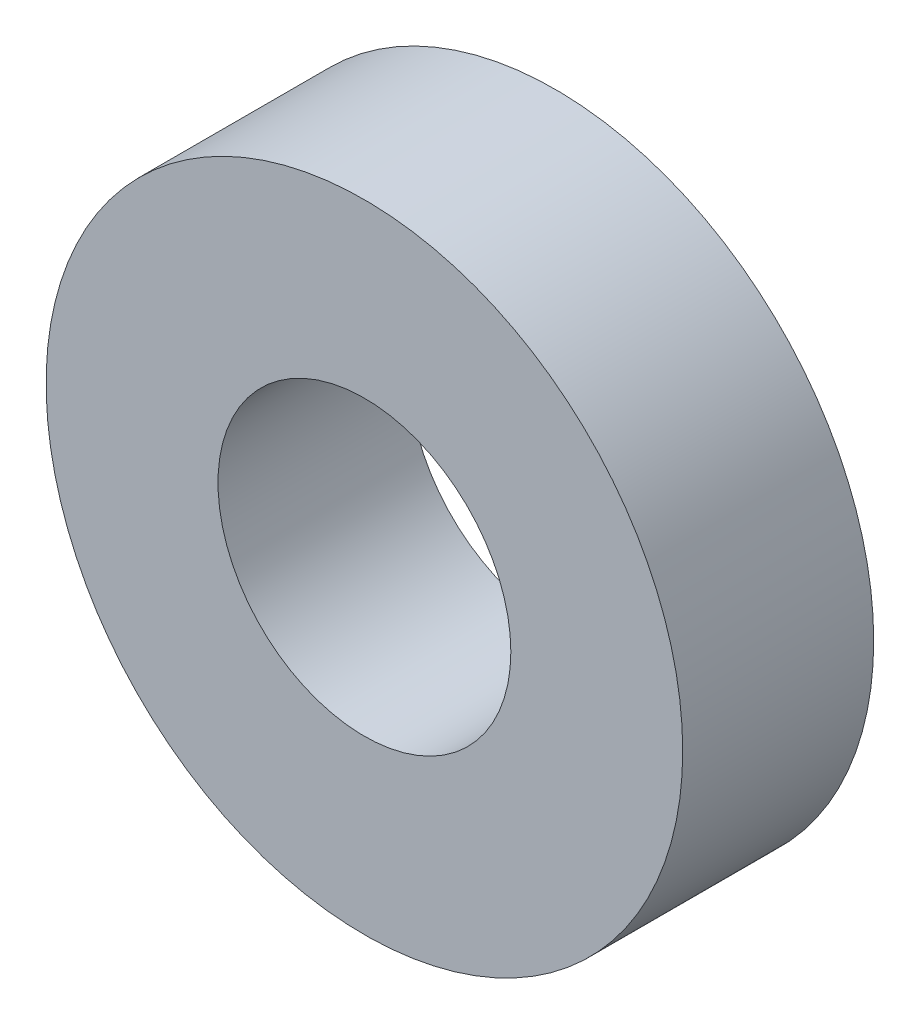
ISO-10303-21;
HEADER;
FILE_DESCRIPTION(('STEP AP214'),'2;1');
FILE_NAME('part.step','',(''),(''),'','','');
FILE_SCHEMA(('AUTOMOTIVE_DESIGN { 1 0 10303 214 1 1 1 1 }'));
ENDSEC;
DATA;
#1=APPLICATION_CONTEXT('core data for automotive mechanical design processes');
#2=APPLICATION_PROTOCOL_DEFINITION('international standard','automotive_design',2000,#1);
#3=PRODUCT_CONTEXT('',#1,'mechanical');
#4=PRODUCT('Part','Part','',(#3));
#5=PRODUCT_RELATED_PRODUCT_CATEGORY('part','',(#4));
#6=PRODUCT_DEFINITION_FORMATION('','',#4);
#7=PRODUCT_DEFINITION_CONTEXT('part definition',#1,'design');
#8=PRODUCT_DEFINITION('design','',#6,#7);
#9=PRODUCT_DEFINITION_SHAPE('','',#8);
#10=(LENGTH_UNIT() NAMED_UNIT(*) SI_UNIT(.MILLI.,.METRE.));
#11=(NAMED_UNIT(*) PLANE_ANGLE_UNIT() SI_UNIT($,.RADIAN.));
#12=(NAMED_UNIT(*) SI_UNIT($,.STERADIAN.) SOLID_ANGLE_UNIT());
#13=UNCERTAINTY_MEASURE_WITH_UNIT(LENGTH_MEASURE(1.E-05),#10,'distance_accuracy_value','');
#14=(GEOMETRIC_REPRESENTATION_CONTEXT(3) GLOBAL_UNCERTAINTY_ASSIGNED_CONTEXT((#13)) GLOBAL_UNIT_ASSIGNED_CONTEXT((#10,
#11,#12)) REPRESENTATION_CONTEXT('',''));
#15=CARTESIAN_POINT('',(0.,0.,0.));
#16=DIRECTION('',(0.,0.,1.));
#17=DIRECTION('',(1.,0.,0.));
#18=AXIS2_PLACEMENT_3D('',#15,#16,#17);
#19=CARTESIAN_POINT('',(0.,0.,3.));
#20=DIRECTION('',(0.,0.,1.));
#21=DIRECTION('',(1.,0.,0.));
#22=AXIS2_PLACEMENT_3D('',#19,#20,#21);
#23=PLANE('',#22);
#24=CARTESIAN_POINT('',(0.,0.,3.));
#25=DIRECTION('',(0.,0.,1.));
#26=DIRECTION('',(1.,0.,0.));
#27=AXIS2_PLACEMENT_3D('',#24,#25,#26);
#28=CIRCLE('',#27,5.);
#29=CARTESIAN_POINT('',(5.,0.,3.));
#30=VERTEX_POINT('',#29);
#31=EDGE_CURVE('E10',#30,#30,#28,.T.);
#32=ORIENTED_EDGE('',*,*,#31,.T.);
#33=EDGE_LOOP('',(#32));
#34=FACE_BOUND('',#33,.T.);
#35=CARTESIAN_POINT('',(0.,0.,3.));
#36=DIRECTION('',(0.,0.,1.));
#37=DIRECTION('',(1.,0.,0.));
#38=AXIS2_PLACEMENT_3D('',#35,#36,#37);
#39=CIRCLE('',#38,2.3);
#40=CARTESIAN_POINT('',(2.3,0.,3.));
#41=VERTEX_POINT('',#40);
#42=EDGE_CURVE('E41',#41,#41,#39,.T.);
#43=ORIENTED_EDGE('',*,*,#42,.F.);
#44=EDGE_LOOP('',(#43));
#45=FACE_BOUND('',#44,.T.);
#46=ADVANCED_FACE('F30',(#34,#45),#23,.T.);
#47=CARTESIAN_POINT('',(0.,0.,0.));
#48=DIRECTION('',(0.,0.,1.));
#49=DIRECTION('',(1.,0.,0.));
#50=AXIS2_PLACEMENT_3D('',#47,#48,#49);
#51=PLANE('',#50);
#52=CARTESIAN_POINT('',(0.,0.,0.));
#53=DIRECTION('',(0.,0.,1.));
#54=DIRECTION('',(1.,0.,0.));
#55=AXIS2_PLACEMENT_3D('',#52,#53,#54);
#56=CIRCLE('',#55,5.);
#57=CARTESIAN_POINT('',(5.,0.,0.));
#58=VERTEX_POINT('',#57);
#59=EDGE_CURVE('E34',#58,#58,#56,.T.);
#60=ORIENTED_EDGE('',*,*,#59,.F.);
#61=EDGE_LOOP('',(#60));
#62=FACE_BOUND('',#61,.T.);
#63=CARTESIAN_POINT('',(0.,0.,0.));
#64=DIRECTION('',(0.,0.,1.));
#65=DIRECTION('',(1.,0.,0.));
#66=AXIS2_PLACEMENT_3D('',#63,#64,#65);
#67=CIRCLE('',#66,2.3);
#68=CARTESIAN_POINT('',(2.3,0.,0.));
#69=VERTEX_POINT('',#68);
#70=EDGE_CURVE('E43',#69,#69,#67,.T.);
#71=ORIENTED_EDGE('',*,*,#70,.T.);
#72=EDGE_LOOP('',(#71));
#73=FACE_BOUND('',#72,.T.);
#74=ADVANCED_FACE('F53',(#62,#73),#51,.F.);
#75=CARTESIAN_POINT('',(0.,0.,3.));
#76=DIRECTION('',(0.,0.,-1.));
#77=DIRECTION('',(-1.,0.,0.));
#78=AXIS2_PLACEMENT_3D('',#75,#76,#77);
#79=CYLINDRICAL_SURFACE('',#78,5.);
#80=ORIENTED_EDGE('',*,*,#31,.F.);
#81=EDGE_LOOP('',(#80));
#82=FACE_BOUND('',#81,.T.);
#83=ORIENTED_EDGE('',*,*,#59,.T.);
#84=EDGE_LOOP('',(#83));
#85=FACE_BOUND('',#84,.T.);
#86=ADVANCED_FACE('F32',(#82,#85),#79,.T.);
#87=CARTESIAN_POINT('',(0.,0.,3.));
#88=DIRECTION('',(0.,0.,-1.));
#89=DIRECTION('',(-1.,0.,0.));
#90=AXIS2_PLACEMENT_3D('',#87,#88,#89);
#91=CYLINDRICAL_SURFACE('',#90,2.3);
#92=ORIENTED_EDGE('',*,*,#42,.T.);
#93=EDGE_LOOP('',(#92));
#94=FACE_BOUND('',#93,.T.);
#95=ORIENTED_EDGE('',*,*,#70,.F.);
#96=EDGE_LOOP('',(#95));
#97=FACE_BOUND('',#96,.T.);
#98=ADVANCED_FACE('F49',(#94,#97),#91,.F.);
#99=CLOSED_SHELL('',(#46,#74,#86,#98));
#100=MANIFOLD_SOLID_BREP('B2',#99);
#101=ADVANCED_BREP_SHAPE_REPRESENTATION('',(#18,#100),#14);
#102=SHAPE_DEFINITION_REPRESENTATION(#9,#101);
ENDSEC;
END-ISO-10303-21;
